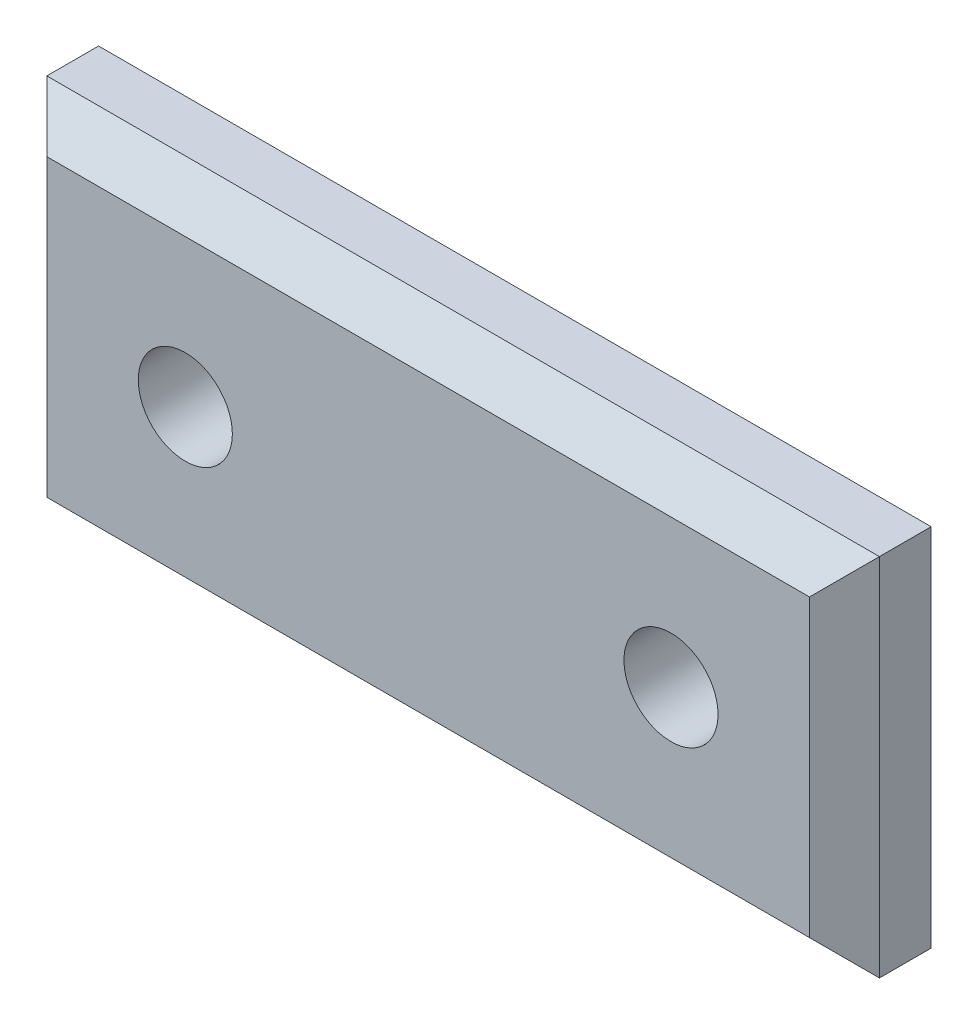
ISO-10303-21;
HEADER;
FILE_DESCRIPTION(('STEP AP214'),'2;1');
FILE_NAME('part.step','',(''),(''),'','','');
FILE_SCHEMA(('AUTOMOTIVE_DESIGN { 1 0 10303 214 1 1 1 1 }'));
ENDSEC;
DATA;
#1=APPLICATION_CONTEXT('core data for automotive mechanical design processes');
#2=APPLICATION_PROTOCOL_DEFINITION('international standard','automotive_design',2000,#1);
#3=PRODUCT_CONTEXT('',#1,'mechanical');
#4=PRODUCT('Part','Part','',(#3));
#5=PRODUCT_RELATED_PRODUCT_CATEGORY('part','',(#4));
#6=PRODUCT_DEFINITION_FORMATION('','',#4);
#7=PRODUCT_DEFINITION_CONTEXT('part definition',#1,'design');
#8=PRODUCT_DEFINITION('design','',#6,#7);
#9=PRODUCT_DEFINITION_SHAPE('','',#8);
#10=(LENGTH_UNIT() NAMED_UNIT(*) SI_UNIT(.MILLI.,.METRE.));
#11=(NAMED_UNIT(*) PLANE_ANGLE_UNIT() SI_UNIT($,.RADIAN.));
#12=(NAMED_UNIT(*) SI_UNIT($,.STERADIAN.) SOLID_ANGLE_UNIT());
#13=UNCERTAINTY_MEASURE_WITH_UNIT(LENGTH_MEASURE(1.E-05),#10,'distance_accuracy_value','');
#14=(GEOMETRIC_REPRESENTATION_CONTEXT(3) GLOBAL_UNCERTAINTY_ASSIGNED_CONTEXT((#13)) GLOBAL_UNIT_ASSIGNED_CONTEXT((#10,
#11,#12)) REPRESENTATION_CONTEXT('',''));
#15=CARTESIAN_POINT('',(0.,0.,0.));
#16=DIRECTION('',(0.,0.,1.));
#17=DIRECTION('',(1.,0.,0.));
#18=AXIS2_PLACEMENT_3D('',#15,#16,#17);
#19=CARTESIAN_POINT('',(19.05,-8.35025,3.96875));
#20=DIRECTION('',(-1.,0.,0.));
#21=DIRECTION('',(0.,0.,1.));
#22=AXIS2_PLACEMENT_3D('',#19,#20,#21);
#23=PLANE('',#22);
#24=DIRECTION('',(0.,0.,-1.));
#25=VECTOR('',#24,1.);
#26=CARTESIAN_POINT('',(19.05,8.35025,3.96875));
#27=LINE('',#26,#25);
#28=CARTESIAN_POINT('',(19.05,8.35025,2.36854999999999));
#29=VERTEX_POINT('',#28);
#30=CARTESIAN_POINT('',(19.05,8.35025,0.));
#31=VERTEX_POINT('',#30);
#32=EDGE_CURVE('E85',#29,#31,#27,.T.);
#33=ORIENTED_EDGE('',*,*,#32,.F.);
#34=DIRECTION('',(0.,-1.,0.));
#35=VECTOR('',#34,1.);
#36=CARTESIAN_POINT('',(19.05,-8.35025,2.36854999999999));
#37=LINE('',#36,#35);
#38=CARTESIAN_POINT('',(19.05,-8.35025,2.36854999999999));
#39=VERTEX_POINT('',#38);
#40=EDGE_CURVE('E132',#29,#39,#37,.T.);
#41=ORIENTED_EDGE('',*,*,#40,.T.);
#42=DIRECTION('',(0.,0.,-1.));
#43=VECTOR('',#42,1.);
#44=CARTESIAN_POINT('',(19.05,-8.35025,3.96875));
#45=LINE('',#44,#43);
#46=CARTESIAN_POINT('',(19.05,-8.35025,0.));
#47=VERTEX_POINT('',#46);
#48=EDGE_CURVE('E105',#39,#47,#45,.T.);
#49=ORIENTED_EDGE('',*,*,#48,.T.);
#50=DIRECTION('',(0.,1.,0.));
#51=VECTOR('',#50,1.);
#52=CARTESIAN_POINT('',(19.05,-8.35025,0.));
#53=LINE('',#52,#51);
#54=EDGE_CURVE('E100',#47,#31,#53,.T.);
#55=ORIENTED_EDGE('',*,*,#54,.T.);
#56=EDGE_LOOP('',(#33,#41,#49,#55));
#57=FACE_BOUND('',#56,.T.);
#58=ADVANCED_FACE('F34',(#57),#23,.F.);
#59=CARTESIAN_POINT('',(-19.05,8.35025,3.96875));
#60=DIRECTION('',(0.,-1.,0.));
#61=DIRECTION('',(0.,0.,-1.));
#62=AXIS2_PLACEMENT_3D('',#59,#60,#61);
#63=PLANE('',#62);
#64=DIRECTION('',(0.,0.,-1.));
#65=VECTOR('',#64,1.);
#66=CARTESIAN_POINT('',(-19.05,8.35025,3.96875));
#67=LINE('',#66,#65);
#68=CARTESIAN_POINT('',(-19.05,8.35025,2.36854999999999));
#69=VERTEX_POINT('',#68);
#70=CARTESIAN_POINT('',(-19.05,8.35025,0.));
#71=VERTEX_POINT('',#70);
#72=EDGE_CURVE('E94',#69,#71,#67,.T.);
#73=ORIENTED_EDGE('',*,*,#72,.F.);
#74=DIRECTION('',(1.,0.,0.));
#75=VECTOR('',#74,1.);
#76=CARTESIAN_POINT('',(-19.05,8.35025,2.36854999999999));
#77=LINE('',#76,#75);
#78=EDGE_CURVE('E43',#69,#29,#77,.T.);
#79=ORIENTED_EDGE('',*,*,#78,.T.);
#80=ORIENTED_EDGE('',*,*,#32,.T.);
#81=DIRECTION('',(-1.,0.,0.));
#82=VECTOR('',#81,1.);
#83=CARTESIAN_POINT('',(-19.05,8.35025,0.));
#84=LINE('',#83,#82);
#85=EDGE_CURVE('E88',#31,#71,#84,.T.);
#86=ORIENTED_EDGE('',*,*,#85,.T.);
#87=EDGE_LOOP('',(#73,#79,#80,#86));
#88=FACE_BOUND('',#87,.T.);
#89=ADVANCED_FACE('F87',(#88),#63,.F.);
#90=CARTESIAN_POINT('',(-19.05,-8.35025,3.96875));
#91=DIRECTION('',(1.,0.,0.));
#92=DIRECTION('',(0.,0.,-1.));
#93=AXIS2_PLACEMENT_3D('',#90,#91,#92);
#94=PLANE('',#93);
#95=DIRECTION('',(0.,0.,-1.));
#96=VECTOR('',#95,1.);
#97=CARTESIAN_POINT('',(-19.05,-8.35025,3.96875));
#98=LINE('',#97,#96);
#99=CARTESIAN_POINT('',(-19.05,-8.35025,2.36854999999999));
#100=VERTEX_POINT('',#99);
#101=CARTESIAN_POINT('',(-19.05,-8.35025,0.));
#102=VERTEX_POINT('',#101);
#103=EDGE_CURVE('E118',#100,#102,#98,.T.);
#104=ORIENTED_EDGE('',*,*,#103,.F.);
#105=DIRECTION('',(0.,1.,0.));
#106=VECTOR('',#105,1.);
#107=CARTESIAN_POINT('',(-19.05,-8.35025,2.36854999999999));
#108=LINE('',#107,#106);
#109=EDGE_CURVE('E11',#100,#69,#108,.T.);
#110=ORIENTED_EDGE('',*,*,#109,.T.);
#111=ORIENTED_EDGE('',*,*,#72,.T.);
#112=DIRECTION('',(0.,-1.,0.));
#113=VECTOR('',#112,1.);
#114=CARTESIAN_POINT('',(-19.05,-8.35025,0.));
#115=LINE('',#114,#113);
#116=EDGE_CURVE('E102',#71,#102,#115,.T.);
#117=ORIENTED_EDGE('',*,*,#116,.T.);
#118=EDGE_LOOP('',(#104,#110,#111,#117));
#119=FACE_BOUND('',#118,.T.);
#120=ADVANCED_FACE('F171',(#119),#94,.F.);
#121=CARTESIAN_POINT('',(-19.05,-8.35025,3.96875));
#122=DIRECTION('',(0.,1.,0.));
#123=DIRECTION('',(0.,0.,1.));
#124=AXIS2_PLACEMENT_3D('',#121,#122,#123);
#125=PLANE('',#124);
#126=ORIENTED_EDGE('',*,*,#48,.F.);
#127=DIRECTION('',(-1.,0.,0.));
#128=VECTOR('',#127,1.);
#129=CARTESIAN_POINT('',(-19.05,-8.35025,2.36854999999999));
#130=LINE('',#129,#128);
#131=EDGE_CURVE('E129',#39,#100,#130,.T.);
#132=ORIENTED_EDGE('',*,*,#131,.T.);
#133=ORIENTED_EDGE('',*,*,#103,.T.);
#134=DIRECTION('',(1.,0.,0.));
#135=VECTOR('',#134,1.);
#136=CARTESIAN_POINT('',(-19.05,-8.35025,0.));
#137=LINE('',#136,#135);
#138=EDGE_CURVE('E115',#102,#47,#137,.T.);
#139=ORIENTED_EDGE('',*,*,#138,.T.);
#140=EDGE_LOOP('',(#126,#132,#133,#139));
#141=FACE_BOUND('',#140,.T.);
#142=ADVANCED_FACE('F162',(#141),#125,.F.);
#143=CARTESIAN_POINT('',(0.,0.,3.96875));
#144=DIRECTION('',(0.,0.,-1.));
#145=DIRECTION('',(-1.,0.,0.));
#146=AXIS2_PLACEMENT_3D('',#143,#144,#145);
#147=PLANE('',#146);
#148=DIRECTION('',(0.,-1.,0.));
#149=VECTOR('',#148,1.);
#150=CARTESIAN_POINT('',(-17.4498,0.,3.96875));
#151=LINE('',#150,#149);
#152=CARTESIAN_POINT('',(-17.4498,6.75005,3.96875));
#153=VERTEX_POINT('',#152);
#154=CARTESIAN_POINT('',(-17.4498,-6.75005,3.96875));
#155=VERTEX_POINT('',#154);
#156=EDGE_CURVE('E93',#153,#155,#151,.T.);
#157=ORIENTED_EDGE('',*,*,#156,.T.);
#158=DIRECTION('',(1.,0.,0.));
#159=VECTOR('',#158,1.);
#160=CARTESIAN_POINT('',(0.,-6.75005,3.96875));
#161=LINE('',#160,#159);
#162=CARTESIAN_POINT('',(17.4498,-6.75005,3.96875));
#163=VERTEX_POINT('',#162);
#164=EDGE_CURVE('E126',#155,#163,#161,.T.);
#165=ORIENTED_EDGE('',*,*,#164,.T.);
#166=DIRECTION('',(0.,1.,0.));
#167=VECTOR('',#166,1.);
#168=CARTESIAN_POINT('',(17.4498,0.,3.96875));
#169=LINE('',#168,#167);
#170=CARTESIAN_POINT('',(17.4498,6.75005,3.96875));
#171=VERTEX_POINT('',#170);
#172=EDGE_CURVE('E124',#163,#171,#169,.T.);
#173=ORIENTED_EDGE('',*,*,#172,.T.);
#174=DIRECTION('',(-1.,0.,0.));
#175=VECTOR('',#174,1.);
#176=CARTESIAN_POINT('',(0.,6.75005,3.96875));
#177=LINE('',#176,#175);
#178=EDGE_CURVE('E122',#171,#153,#177,.T.);
#179=ORIENTED_EDGE('',*,*,#178,.T.);
#180=EDGE_LOOP('',(#157,#165,#173,#179));
#181=FACE_BOUND('',#180,.T.);
#182=CARTESIAN_POINT('',(-11.1125,0.,3.96875));
#183=DIRECTION('',(0.,0.,1.));
#184=DIRECTION('',(1.,0.,0.));
#185=AXIS2_PLACEMENT_3D('',#182,#183,#184);
#186=CIRCLE('',#185,2.15265);
#187=CARTESIAN_POINT('',(-8.95985,0.,3.96875));
#188=VERTEX_POINT('',#187);
#189=EDGE_CURVE('E144',#188,#188,#186,.T.);
#190=ORIENTED_EDGE('',*,*,#189,.F.);
#191=EDGE_LOOP('',(#190));
#192=FACE_BOUND('',#191,.T.);
#193=CARTESIAN_POINT('',(11.1125,0.,3.96875));
#194=DIRECTION('',(0.,0.,1.));
#195=DIRECTION('',(1.,0.,0.));
#196=AXIS2_PLACEMENT_3D('',#193,#194,#195);
#197=CIRCLE('',#196,2.15265);
#198=CARTESIAN_POINT('',(13.26515,0.,3.96875));
#199=VERTEX_POINT('',#198);
#200=EDGE_CURVE('E110',#199,#199,#197,.T.);
#201=ORIENTED_EDGE('',*,*,#200,.F.);
#202=EDGE_LOOP('',(#201));
#203=FACE_BOUND('',#202,.T.);
#204=ADVANCED_FACE('F160',(#181,#192,#203),#147,.F.);
#205=CARTESIAN_POINT('',(0.,0.,0.));
#206=DIRECTION('',(0.,0.,-1.));
#207=DIRECTION('',(-1.,0.,0.));
#208=AXIS2_PLACEMENT_3D('',#205,#206,#207);
#209=PLANE('',#208);
#210=CARTESIAN_POINT('',(-11.1125,0.,0.));
#211=DIRECTION('',(0.,0.,1.));
#212=DIRECTION('',(1.,0.,0.));
#213=AXIS2_PLACEMENT_3D('',#210,#211,#212);
#214=CIRCLE('',#213,2.15265);
#215=CARTESIAN_POINT('',(-8.95985,0.,0.));
#216=VERTEX_POINT('',#215);
#217=EDGE_CURVE('E149',#216,#216,#214,.T.);
#218=ORIENTED_EDGE('',*,*,#217,.T.);
#219=EDGE_LOOP('',(#218));
#220=FACE_BOUND('',#219,.T.);
#221=CARTESIAN_POINT('',(11.1125,0.,0.));
#222=DIRECTION('',(0.,0.,1.));
#223=DIRECTION('',(1.,0.,0.));
#224=AXIS2_PLACEMENT_3D('',#221,#222,#223);
#225=CIRCLE('',#224,2.15265);
#226=CARTESIAN_POINT('',(13.26515,0.,0.));
#227=VERTEX_POINT('',#226);
#228=EDGE_CURVE('E107',#227,#227,#225,.T.);
#229=ORIENTED_EDGE('',*,*,#228,.T.);
#230=EDGE_LOOP('',(#229));
#231=FACE_BOUND('',#230,.T.);
#232=ORIENTED_EDGE('',*,*,#54,.F.);
#233=ORIENTED_EDGE('',*,*,#138,.F.);
#234=ORIENTED_EDGE('',*,*,#116,.F.);
#235=ORIENTED_EDGE('',*,*,#85,.F.);
#236=EDGE_LOOP('',(#232,#233,#234,#235));
#237=FACE_BOUND('',#236,.T.);
#238=ADVANCED_FACE('F98',(#220,#231,#237),#209,.T.);
#239=CARTESIAN_POINT('',(11.1125,0.,3.96875));
#240=DIRECTION('',(0.,0.,1.));
#241=DIRECTION('',(1.,0.,0.));
#242=AXIS2_PLACEMENT_3D('',#239,#240,#241);
#243=CYLINDRICAL_SURFACE('',#242,2.15265);
#244=ORIENTED_EDGE('',*,*,#228,.F.);
#245=EDGE_LOOP('',(#244));
#246=FACE_BOUND('',#245,.T.);
#247=ORIENTED_EDGE('',*,*,#200,.T.);
#248=EDGE_LOOP('',(#247));
#249=FACE_BOUND('',#248,.T.);
#250=ADVANCED_FACE('F158',(#246,#249),#243,.F.);
#251=CARTESIAN_POINT('',(-11.1125,0.,3.96875));
#252=DIRECTION('',(0.,0.,1.));
#253=DIRECTION('',(1.,0.,0.));
#254=AXIS2_PLACEMENT_3D('',#251,#252,#253);
#255=CYLINDRICAL_SURFACE('',#254,2.15265);
#256=ORIENTED_EDGE('',*,*,#217,.F.);
#257=EDGE_LOOP('',(#256));
#258=FACE_BOUND('',#257,.T.);
#259=ORIENTED_EDGE('',*,*,#189,.T.);
#260=EDGE_LOOP('',(#259));
#261=FACE_BOUND('',#260,.T.);
#262=ADVANCED_FACE('F195',(#258,#261),#255,.F.);
#263=CARTESIAN_POINT('',(0.,6.75005,3.96875));
#264=DIRECTION('',(0.,-0.70710678118655,-0.707106781186545));
#265=DIRECTION('',(-1.,0.,0.));
#266=AXIS2_PLACEMENT_3D('',#263,#264,#265);
#267=PLANE('',#266);
#268=DIRECTION('',(0.577350269189625,0.577350269189625,-0.577350269189628));
#269=VECTOR('',#268,1.);
#270=CARTESIAN_POINT('',(11.6332,0.933450000000024,9.78535000000001));
#271=LINE('',#270,#269);
#272=EDGE_CURVE('E138',#29,#171,#271,.F.);
#273=ORIENTED_EDGE('',*,*,#272,.F.);
#274=ORIENTED_EDGE('',*,*,#78,.F.);
#275=DIRECTION('',(-0.577350269189625,0.577350269189625,-0.577350269189628));
#276=VECTOR('',#275,1.);
#277=CARTESIAN_POINT('',(-15.1997833333333,4.50003333333334,6.21876666666667));
#278=LINE('',#277,#276);
#279=EDGE_CURVE('E38',#153,#69,#278,.T.);
#280=ORIENTED_EDGE('',*,*,#279,.F.);
#281=ORIENTED_EDGE('',*,*,#178,.F.);
#282=EDGE_LOOP('',(#273,#274,#280,#281));
#283=FACE_BOUND('',#282,.T.);
#284=ADVANCED_FACE('F36',(#283),#267,.F.);
#285=CARTESIAN_POINT('',(-17.4498,0.,3.96875));
#286=DIRECTION('',(0.70710678118655,0.,-0.707106781186545));
#287=DIRECTION('',(0.,-1.,0.));
#288=AXIS2_PLACEMENT_3D('',#285,#286,#287);
#289=PLANE('',#288);
#290=ORIENTED_EDGE('',*,*,#279,.T.);
#291=ORIENTED_EDGE('',*,*,#109,.F.);
#292=DIRECTION('',(0.577350269189625,0.577350269189625,0.577350269189628));
#293=VECTOR('',#292,1.);
#294=CARTESIAN_POINT('',(-15.1997833333333,-4.50003333333335,6.21876666666667));
#295=LINE('',#294,#293);
#296=EDGE_CURVE('E137',#155,#100,#295,.F.);
#297=ORIENTED_EDGE('',*,*,#296,.F.);
#298=ORIENTED_EDGE('',*,*,#156,.F.);
#299=EDGE_LOOP('',(#290,#291,#297,#298));
#300=FACE_BOUND('',#299,.T.);
#301=ADVANCED_FACE('F190',(#300),#289,.F.);
#302=CARTESIAN_POINT('',(17.4498,0.,3.96875));
#303=DIRECTION('',(-0.70710678118655,0.,-0.707106781186545));
#304=DIRECTION('',(0.,1.,0.));
#305=AXIS2_PLACEMENT_3D('',#302,#303,#304);
#306=PLANE('',#305);
#307=ORIENTED_EDGE('',*,*,#272,.T.);
#308=ORIENTED_EDGE('',*,*,#172,.F.);
#309=DIRECTION('',(0.577350269189625,-0.577350269189625,-0.577350269189628));
#310=VECTOR('',#309,1.);
#311=CARTESIAN_POINT('',(15.1997833333333,-4.50003333333335,6.21876666666667));
#312=LINE('',#311,#310);
#313=EDGE_CURVE('E135',#39,#163,#312,.F.);
#314=ORIENTED_EDGE('',*,*,#313,.F.);
#315=ORIENTED_EDGE('',*,*,#40,.F.);
#316=EDGE_LOOP('',(#307,#308,#314,#315));
#317=FACE_BOUND('',#316,.T.);
#318=ADVANCED_FACE('F187',(#317),#306,.F.);
#319=CARTESIAN_POINT('',(0.,-6.75005,3.96875));
#320=DIRECTION('',(0.,0.70710678118655,-0.707106781186545));
#321=DIRECTION('',(1.,0.,0.));
#322=AXIS2_PLACEMENT_3D('',#319,#320,#321);
#323=PLANE('',#322);
#324=ORIENTED_EDGE('',*,*,#296,.T.);
#325=ORIENTED_EDGE('',*,*,#131,.F.);
#326=ORIENTED_EDGE('',*,*,#313,.T.);
#327=ORIENTED_EDGE('',*,*,#164,.F.);
#328=EDGE_LOOP('',(#324,#325,#326,#327));
#329=FACE_BOUND('',#328,.T.);
#330=ADVANCED_FACE('F184',(#329),#323,.F.);
#331=CLOSED_SHELL('',(#58,#89,#120,#142,#204,#238,#250,#262,#284,#301,#318,#330));
#332=MANIFOLD_SOLID_BREP('B2',#331);
#333=ADVANCED_BREP_SHAPE_REPRESENTATION('',(#18,#332),#14);
#334=SHAPE_DEFINITION_REPRESENTATION(#9,#333);
ENDSEC;
END-ISO-10303-21;
